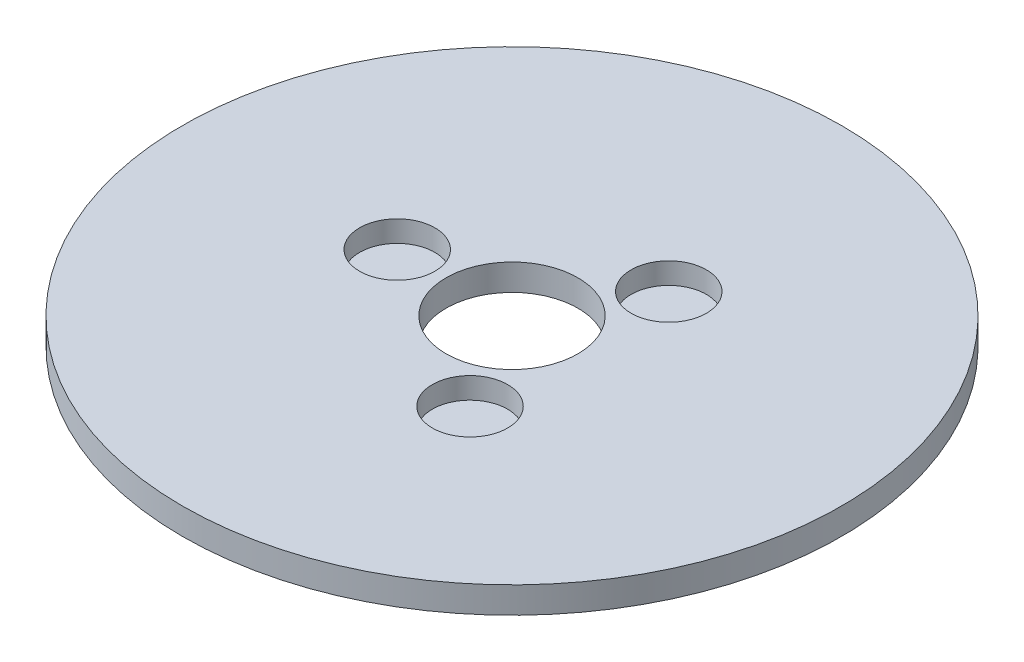
ISO-10303-21;
HEADER;
FILE_DESCRIPTION(('STEP AP214'),'2;1');
FILE_NAME('part.step','',(''),(''),'','','');
FILE_SCHEMA(('AUTOMOTIVE_DESIGN { 1 0 10303 214 1 1 1 1 }'));
ENDSEC;
DATA;
#1=APPLICATION_CONTEXT('core data for automotive mechanical design processes');
#2=APPLICATION_PROTOCOL_DEFINITION('international standard','automotive_design',2000,#1);
#3=PRODUCT_CONTEXT('',#1,'mechanical');
#4=PRODUCT('Part','Part','',(#3));
#5=PRODUCT_RELATED_PRODUCT_CATEGORY('part','',(#4));
#6=PRODUCT_DEFINITION_FORMATION('','',#4);
#7=PRODUCT_DEFINITION_CONTEXT('part definition',#1,'design');
#8=PRODUCT_DEFINITION('design','',#6,#7);
#9=PRODUCT_DEFINITION_SHAPE('','',#8);
#10=(LENGTH_UNIT() NAMED_UNIT(*) SI_UNIT(.MILLI.,.METRE.));
#11=(NAMED_UNIT(*) PLANE_ANGLE_UNIT() SI_UNIT($,.RADIAN.));
#12=(NAMED_UNIT(*) SI_UNIT($,.STERADIAN.) SOLID_ANGLE_UNIT());
#13=UNCERTAINTY_MEASURE_WITH_UNIT(LENGTH_MEASURE(1.E-05),#10,'distance_accuracy_value','');
#14=(GEOMETRIC_REPRESENTATION_CONTEXT(3) GLOBAL_UNCERTAINTY_ASSIGNED_CONTEXT((#13)) GLOBAL_UNIT_ASSIGNED_CONTEXT((#10,
#11,#12)) REPRESENTATION_CONTEXT('',''));
#15=CARTESIAN_POINT('',(0.,0.,0.));
#16=DIRECTION('',(0.,0.,1.));
#17=DIRECTION('',(1.,0.,0.));
#18=AXIS2_PLACEMENT_3D('',#15,#16,#17);
#19=CARTESIAN_POINT('',(0.,7.,0.));
#20=DIRECTION('',(0.,-1.,0.));
#21=DIRECTION('',(0.,0.,-1.));
#22=AXIS2_PLACEMENT_3D('',#19,#20,#21);
#23=CYLINDRICAL_SURFACE('',#22,87.5);
#24=CARTESIAN_POINT('',(0.,7.,0.));
#25=DIRECTION('',(0.,1.,0.));
#26=DIRECTION('',(0.,0.,1.));
#27=AXIS2_PLACEMENT_3D('',#24,#25,#26);
#28=CIRCLE('',#27,87.5);
#29=CARTESIAN_POINT('',(0.,7.,87.5));
#30=VERTEX_POINT('',#29);
#31=EDGE_CURVE('E10',#30,#30,#28,.T.);
#32=ORIENTED_EDGE('',*,*,#31,.F.);
#33=EDGE_LOOP('',(#32));
#34=FACE_BOUND('',#33,.T.);
#35=CARTESIAN_POINT('',(0.,0.,0.));
#36=DIRECTION('',(0.,1.,0.));
#37=DIRECTION('',(0.,0.,1.));
#38=AXIS2_PLACEMENT_3D('',#35,#36,#37);
#39=CIRCLE('',#38,87.5);
#40=CARTESIAN_POINT('',(0.,0.,87.5));
#41=VERTEX_POINT('',#40);
#42=EDGE_CURVE('E37',#41,#41,#39,.T.);
#43=ORIENTED_EDGE('',*,*,#42,.T.);
#44=EDGE_LOOP('',(#43));
#45=FACE_BOUND('',#44,.T.);
#46=ADVANCED_FACE('F40',(#34,#45),#23,.T.);
#47=CARTESIAN_POINT('',(0.,7.,0.));
#48=DIRECTION('',(0.,1.,0.));
#49=DIRECTION('',(0.,0.,1.));
#50=AXIS2_PLACEMENT_3D('',#47,#48,#49);
#51=PLANE('',#50);
#52=CARTESIAN_POINT('',(15.2350539332547,7.,26.3878874684488));
#53=DIRECTION('',(0.,1.,0.));
#54=DIRECTION('',(0.866025403784436,0.,-0.500000000000004));
#55=AXIS2_PLACEMENT_3D('',#52,#53,#54);
#56=CIRCLE('',#55,10.);
#57=CARTESIAN_POINT('',(15.2350539332547,7.,36.3878874684488));
#58=VERTEX_POINT('',#57);
#59=EDGE_CURVE('E70',#58,#58,#56,.T.);
#60=ORIENTED_EDGE('',*,*,#59,.F.);
#61=EDGE_LOOP('',(#60));
#62=FACE_BOUND('',#61,.T.);
#63=CARTESIAN_POINT('',(15.2350539332543,7.,-26.387887468449));
#64=DIRECTION('',(0.,1.,0.));
#65=DIRECTION('',(-0.866025403784443,0.,-0.499999999999992));
#66=AXIS2_PLACEMENT_3D('',#63,#64,#65);
#67=CIRCLE('',#66,10.);
#68=CARTESIAN_POINT('',(15.2350539332543,7.,-16.387887468449));
#69=VERTEX_POINT('',#68);
#70=EDGE_CURVE('E61',#69,#69,#67,.T.);
#71=ORIENTED_EDGE('',*,*,#70,.F.);
#72=EDGE_LOOP('',(#71));
#73=FACE_BOUND('',#72,.T.);
#74=CARTESIAN_POINT('',(-30.4701078665091,7.,0.));
#75=DIRECTION('',(0.,1.,0.));
#76=DIRECTION('',(0.,0.,1.));
#77=AXIS2_PLACEMENT_3D('',#74,#75,#76);
#78=CIRCLE('',#77,10.);
#79=CARTESIAN_POINT('',(-30.4701078665091,7.,10.));
#80=VERTEX_POINT('',#79);
#81=EDGE_CURVE('E54',#80,#80,#78,.T.);
#82=ORIENTED_EDGE('',*,*,#81,.F.);
#83=EDGE_LOOP('',(#82));
#84=FACE_BOUND('',#83,.T.);
#85=CARTESIAN_POINT('',(0.,7.,0.));
#86=DIRECTION('',(0.,1.,0.));
#87=DIRECTION('',(0.,0.,1.));
#88=AXIS2_PLACEMENT_3D('',#85,#86,#87);
#89=CIRCLE('',#88,17.5);
#90=CARTESIAN_POINT('',(0.,7.,17.5));
#91=VERTEX_POINT('',#90);
#92=EDGE_CURVE('E50',#91,#91,#89,.T.);
#93=ORIENTED_EDGE('',*,*,#92,.F.);
#94=EDGE_LOOP('',(#93));
#95=FACE_BOUND('',#94,.T.);
#96=ORIENTED_EDGE('',*,*,#31,.T.);
#97=EDGE_LOOP('',(#96));
#98=FACE_BOUND('',#97,.T.);
#99=ADVANCED_FACE('F85',(#62,#73,#84,#95,#98),#51,.T.);
#100=CARTESIAN_POINT('',(0.,0.,0.));
#101=DIRECTION('',(0.,1.,0.));
#102=DIRECTION('',(0.,0.,1.));
#103=AXIS2_PLACEMENT_3D('',#100,#101,#102);
#104=PLANE('',#103);
#105=CARTESIAN_POINT('',(0.,0.,0.));
#106=DIRECTION('',(0.,1.,0.));
#107=DIRECTION('',(0.,0.,1.));
#108=AXIS2_PLACEMENT_3D('',#105,#106,#107);
#109=CIRCLE('',#108,17.5);
#110=CARTESIAN_POINT('',(0.,0.,17.5));
#111=VERTEX_POINT('',#110);
#112=EDGE_CURVE('E47',#111,#111,#109,.T.);
#113=ORIENTED_EDGE('',*,*,#112,.T.);
#114=EDGE_LOOP('',(#113));
#115=FACE_BOUND('',#114,.T.);
#116=ORIENTED_EDGE('',*,*,#42,.F.);
#117=EDGE_LOOP('',(#116));
#118=FACE_BOUND('',#117,.T.);
#119=ADVANCED_FACE('F84',(#115,#118),#104,.F.);
#120=CARTESIAN_POINT('',(0.,7.,0.));
#121=DIRECTION('',(0.,-1.,0.));
#122=DIRECTION('',(0.,0.,-1.));
#123=AXIS2_PLACEMENT_3D('',#120,#121,#122);
#124=CYLINDRICAL_SURFACE('',#123,17.5);
#125=ORIENTED_EDGE('',*,*,#92,.T.);
#126=EDGE_LOOP('',(#125));
#127=FACE_BOUND('',#126,.T.);
#128=ORIENTED_EDGE('',*,*,#112,.F.);
#129=EDGE_LOOP('',(#128));
#130=FACE_BOUND('',#129,.T.);
#131=ADVANCED_FACE('F91',(#127,#130),#124,.F.);
#132=CARTESIAN_POINT('',(-30.4701078665091,1.33923318185405,0.));
#133=DIRECTION('',(0.,1.,0.));
#134=DIRECTION('',(0.,0.,1.));
#135=AXIS2_PLACEMENT_3D('',#132,#133,#134);
#136=CYLINDRICAL_SURFACE('',#135,10.);
#137=CARTESIAN_POINT('',(-30.4701078665091,1.33923318185405,0.));
#138=DIRECTION('',(0.,1.,0.));
#139=DIRECTION('',(0.,0.,1.));
#140=AXIS2_PLACEMENT_3D('',#137,#138,#139);
#141=CIRCLE('',#140,10.);
#142=CARTESIAN_POINT('',(-30.4701078665091,1.33923318185405,10.));
#143=VERTEX_POINT('',#142);
#144=EDGE_CURVE('E55',#143,#143,#141,.T.);
#145=CARTESIAN_POINT('',(-30.4701078665091,1.33923318185405,10.));
#146=CARTESIAN_POINT('',(-30.4701078665091,1.3981995028764,10.));
#147=CARTESIAN_POINT('',(-30.4701078665091,1.45716582389875,10.));
#148=CARTESIAN_POINT('',(-30.4701078665091,1.57509846594346,10.));
#149=CARTESIAN_POINT('',(-30.4701078665091,1.63406478696581,10.));
#150=CARTESIAN_POINT('',(-30.4701078665091,1.75199742901052,10.));
#151=CARTESIAN_POINT('',(-30.4701078665091,1.81096375003288,10.));
#152=CARTESIAN_POINT('',(-30.4701078665091,1.92889639207758,10.));
#153=CARTESIAN_POINT('',(-30.4701078665091,1.98786271309994,10.));
#154=CARTESIAN_POINT('',(-30.4701078665091,2.10579535514464,10.));
#155=CARTESIAN_POINT('',(-30.4701078665091,2.164761676167,10.));
#156=CARTESIAN_POINT('',(-30.4701078665091,2.2826943182117,10.));
#157=CARTESIAN_POINT('',(-30.4701078665091,2.34166063923406,10.));
#158=CARTESIAN_POINT('',(-30.4701078665091,2.45959328127877,10.));
#159=CARTESIAN_POINT('',(-30.4701078665091,2.51855960230112,10.));
#160=CARTESIAN_POINT('',(-30.4701078665091,2.63649224434583,10.));
#161=CARTESIAN_POINT('',(-30.4701078665091,2.69545856536818,10.));
#162=CARTESIAN_POINT('',(-30.4701078665091,2.81339120741289,10.));
#163=CARTESIAN_POINT('',(-30.4701078665091,2.87235752843524,10.));
#164=CARTESIAN_POINT('',(-30.4701078665091,2.99029017047995,10.));
#165=CARTESIAN_POINT('',(-30.4701078665091,3.0492564915023,10.));
#166=CARTESIAN_POINT('',(-30.4701078665091,3.16718913354701,10.));
#167=CARTESIAN_POINT('',(-30.4701078665091,3.22615545456936,10.));
#168=CARTESIAN_POINT('',(-30.4701078665091,3.34408809661407,10.));
#169=CARTESIAN_POINT('',(-30.4701078665091,3.40305441763643,10.));
#170=CARTESIAN_POINT('',(-30.4701078665091,3.52098705968113,10.));
#171=CARTESIAN_POINT('',(-30.4701078665091,3.57995338070349,10.));
#172=CARTESIAN_POINT('',(-30.4701078665091,3.69788602274819,10.));
#173=CARTESIAN_POINT('',(-30.4701078665091,3.75685234377055,10.));
#174=CARTESIAN_POINT('',(-30.4701078665091,3.87478498581525,10.));
#175=CARTESIAN_POINT('',(-30.4701078665091,3.93375130683761,10.));
#176=CARTESIAN_POINT('',(-30.4701078665091,4.05168394888232,10.));
#177=CARTESIAN_POINT('',(-30.4701078665091,4.11065026990467,10.));
#178=CARTESIAN_POINT('',(-30.4701078665091,4.22858291194938,10.));
#179=CARTESIAN_POINT('',(-30.4701078665091,4.28754923297173,10.));
#180=CARTESIAN_POINT('',(-30.4701078665091,4.40548187501644,10.));
#181=CARTESIAN_POINT('',(-30.4701078665091,4.46444819603879,10.));
#182=CARTESIAN_POINT('',(-30.4701078665091,4.5823808380835,10.));
#183=CARTESIAN_POINT('',(-30.4701078665091,4.64134715910585,10.));
#184=CARTESIAN_POINT('',(-30.4701078665091,4.75927980115056,10.));
#185=CARTESIAN_POINT('',(-30.4701078665091,4.81824612217291,10.));
#186=CARTESIAN_POINT('',(-30.4701078665091,4.93617876421762,10.));
#187=CARTESIAN_POINT('',(-30.4701078665091,4.99514508523998,10.));
#188=CARTESIAN_POINT('',(-30.4701078665091,5.11307772728468,10.));
#189=CARTESIAN_POINT('',(-30.4701078665091,5.17204404830704,10.));
#190=CARTESIAN_POINT('',(-30.4701078665091,5.28997669035174,10.));
#191=CARTESIAN_POINT('',(-30.4701078665091,5.3489430113741,10.));
#192=CARTESIAN_POINT('',(-30.4701078665091,5.4668756534188,10.));
#193=CARTESIAN_POINT('',(-30.4701078665091,5.52584197444116,10.));
#194=CARTESIAN_POINT('',(-30.4701078665091,5.64377461648586,10.));
#195=CARTESIAN_POINT('',(-30.4701078665091,5.70274093750822,10.));
#196=CARTESIAN_POINT('',(-30.4701078665091,5.82067357955293,10.));
#197=CARTESIAN_POINT('',(-30.4701078665091,5.87963990057528,10.));
#198=CARTESIAN_POINT('',(-30.4701078665091,5.99757254261999,10.));
#199=CARTESIAN_POINT('',(-30.4701078665091,6.05653886364234,10.));
#200=CARTESIAN_POINT('',(-30.4701078665091,6.17447150568705,10.));
#201=CARTESIAN_POINT('',(-30.4701078665091,6.2334378267094,10.));
#202=CARTESIAN_POINT('',(-30.4701078665091,6.35137046875411,10.));
#203=CARTESIAN_POINT('',(-30.4701078665091,6.41033678977646,10.));
#204=CARTESIAN_POINT('',(-30.4701078665091,6.52826943182117,10.));
#205=CARTESIAN_POINT('',(-30.4701078665091,6.58723575284353,10.));
#206=CARTESIAN_POINT('',(-30.4701078665091,6.70516839488823,10.));
#207=CARTESIAN_POINT('',(-30.4701078665091,6.76413471591059,10.));
#208=CARTESIAN_POINT('',(-30.4701078665091,6.88206735795529,10.));
#209=CARTESIAN_POINT('',(-30.4701078665091,6.94103367897765,10.));
#210=CARTESIAN_POINT('',(-30.4701078665091,7.,10.));
#211=B_SPLINE_CURVE_WITH_KNOTS('',3,(#145,#146,#147,#148,#149,#150,#151,#152,#153,#154,#155,
#156,#157,#158,#159,#160,#161,#162,#163,#164,#165,#166,#167,#168,#169,#170,#171,#172,#173,#174,
#175,#176,#177,#178,#179,#180,#181,#182,#183,#184,#185,#186,#187,#188,#189,#190,#191,#192,#193,
#194,#195,#196,#197,#198,#199,#200,#201,#202,#203,#204,#205,#206,#207,#208,#209,#210),
.UNSPECIFIED.,.F.,.F.,(4,2,2,2,2,2,2,2,2,2,2,2,2,2,2,2,2,2,2,2,2,2,2,2,2,2,2,2,2,2,2,2,4),(0.,
0.176898963067061,0.353797926134122,0.530696889201183,0.707595852268244,0.884494815335306,
1.06139377840237,1.23829274146943,1.41519170453649,1.59209066760355,1.76898963067061,
1.94588859373767,2.12278755680473,2.29968651987179,2.47658548293886,2.65348444600592,
2.83038340907298,3.00728237214004,3.1841813352071,3.36108029827416,3.53797926134122,
3.71487822440828,3.89177718747534,4.0686761505424,4.24557511360947,4.42247407667653,
4.59937303974359,4.77627200281065,4.95317096587771,5.13006992894477,5.30696889201183,
5.48386785507889,5.66076681814595),.UNSPECIFIED.);
#212=EDGE_CURVE('BSEAM96',#143,#80,#211,.T.);
#213=ORIENTED_EDGE('',*,*,#144,.F.);
#214=ORIENTED_EDGE('',*,*,#81,.T.);
#215=ORIENTED_EDGE('',*,*,#212,.T.);
#216=ORIENTED_EDGE('',*,*,#212,.F.);
#217=EDGE_LOOP('',(#213,#215,#214,#216));
#218=FACE_BOUND('',#217,.T.);
#219=ADVANCED_FACE('F96',(#218),#136,.F.);
#220=CARTESIAN_POINT('',(-30.4701078665091,1.33923318185405,0.));
#221=DIRECTION('',(0.,1.,0.));
#222=DIRECTION('',(0.,0.,1.));
#223=AXIS2_PLACEMENT_3D('',#220,#221,#222);
#224=PLANE('',#223);
#225=ORIENTED_EDGE('',*,*,#144,.T.);
#226=EDGE_LOOP('',(#225));
#227=FACE_BOUND('',#226,.T.);
#228=ADVANCED_FACE('F127',(#227),#224,.T.);
#229=CARTESIAN_POINT('',(15.2350539332543,1.33923318185405,-26.387887468449));
#230=DIRECTION('',(0.,1.,0.));
#231=DIRECTION('',(0.,0.,1.));
#232=AXIS2_PLACEMENT_3D('',#229,#230,#231);
#233=CYLINDRICAL_SURFACE('',#232,10.);
#234=CARTESIAN_POINT('',(15.2350539332543,1.33923318185405,-26.387887468449));
#235=DIRECTION('',(0.,1.,0.));
#236=DIRECTION('',(-0.866025403784443,0.,-0.499999999999992));
#237=AXIS2_PLACEMENT_3D('',#234,#235,#236);
#238=CIRCLE('',#237,10.);
#239=CARTESIAN_POINT('',(15.2350539332543,1.33923318185405,-16.387887468449));
#240=VERTEX_POINT('',#239);
#241=EDGE_CURVE('E63',#240,#240,#238,.T.);
#242=CARTESIAN_POINT('',(15.2350539332543,1.33923318185405,-16.387887468449));
#243=CARTESIAN_POINT('',(15.2350539332543,1.3981995028764,-16.387887468449));
#244=CARTESIAN_POINT('',(15.2350539332543,1.45716582389875,-16.387887468449));
#245=CARTESIAN_POINT('',(15.2350539332543,1.57509846594346,-16.387887468449));
#246=CARTESIAN_POINT('',(15.2350539332543,1.63406478696581,-16.387887468449));
#247=CARTESIAN_POINT('',(15.2350539332543,1.75199742901052,-16.387887468449));
#248=CARTESIAN_POINT('',(15.2350539332543,1.81096375003288,-16.387887468449));
#249=CARTESIAN_POINT('',(15.2350539332543,1.92889639207758,-16.387887468449));
#250=CARTESIAN_POINT('',(15.2350539332543,1.98786271309994,-16.387887468449));
#251=CARTESIAN_POINT('',(15.2350539332543,2.10579535514464,-16.387887468449));
#252=CARTESIAN_POINT('',(15.2350539332543,2.164761676167,-16.387887468449));
#253=CARTESIAN_POINT('',(15.2350539332543,2.2826943182117,-16.387887468449));
#254=CARTESIAN_POINT('',(15.2350539332543,2.34166063923406,-16.387887468449));
#255=CARTESIAN_POINT('',(15.2350539332543,2.45959328127877,-16.387887468449));
#256=CARTESIAN_POINT('',(15.2350539332543,2.51855960230112,-16.387887468449));
#257=CARTESIAN_POINT('',(15.2350539332543,2.63649224434583,-16.387887468449));
#258=CARTESIAN_POINT('',(15.2350539332543,2.69545856536818,-16.387887468449));
#259=CARTESIAN_POINT('',(15.2350539332543,2.81339120741289,-16.387887468449));
#260=CARTESIAN_POINT('',(15.2350539332543,2.87235752843524,-16.387887468449));
#261=CARTESIAN_POINT('',(15.2350539332543,2.99029017047995,-16.387887468449));
#262=CARTESIAN_POINT('',(15.2350539332543,3.0492564915023,-16.387887468449));
#263=CARTESIAN_POINT('',(15.2350539332543,3.16718913354701,-16.387887468449));
#264=CARTESIAN_POINT('',(15.2350539332543,3.22615545456936,-16.387887468449));
#265=CARTESIAN_POINT('',(15.2350539332543,3.34408809661407,-16.387887468449));
#266=CARTESIAN_POINT('',(15.2350539332543,3.40305441763643,-16.387887468449));
#267=CARTESIAN_POINT('',(15.2350539332543,3.52098705968113,-16.387887468449));
#268=CARTESIAN_POINT('',(15.2350539332543,3.57995338070349,-16.387887468449));
#269=CARTESIAN_POINT('',(15.2350539332543,3.69788602274819,-16.387887468449));
#270=CARTESIAN_POINT('',(15.2350539332543,3.75685234377055,-16.387887468449));
#271=CARTESIAN_POINT('',(15.2350539332543,3.87478498581525,-16.387887468449));
#272=CARTESIAN_POINT('',(15.2350539332543,3.93375130683761,-16.387887468449));
#273=CARTESIAN_POINT('',(15.2350539332543,4.05168394888232,-16.387887468449));
#274=CARTESIAN_POINT('',(15.2350539332543,4.11065026990467,-16.387887468449));
#275=CARTESIAN_POINT('',(15.2350539332543,4.22858291194938,-16.387887468449));
#276=CARTESIAN_POINT('',(15.2350539332543,4.28754923297173,-16.387887468449));
#277=CARTESIAN_POINT('',(15.2350539332543,4.40548187501644,-16.387887468449));
#278=CARTESIAN_POINT('',(15.2350539332543,4.46444819603879,-16.387887468449));
#279=CARTESIAN_POINT('',(15.2350539332543,4.5823808380835,-16.387887468449));
#280=CARTESIAN_POINT('',(15.2350539332543,4.64134715910585,-16.387887468449));
#281=CARTESIAN_POINT('',(15.2350539332543,4.75927980115056,-16.387887468449));
#282=CARTESIAN_POINT('',(15.2350539332543,4.81824612217291,-16.387887468449));
#283=CARTESIAN_POINT('',(15.2350539332543,4.93617876421762,-16.387887468449));
#284=CARTESIAN_POINT('',(15.2350539332543,4.99514508523998,-16.387887468449));
#285=CARTESIAN_POINT('',(15.2350539332543,5.11307772728468,-16.387887468449));
#286=CARTESIAN_POINT('',(15.2350539332543,5.17204404830704,-16.387887468449));
#287=CARTESIAN_POINT('',(15.2350539332543,5.28997669035174,-16.387887468449));
#288=CARTESIAN_POINT('',(15.2350539332543,5.3489430113741,-16.387887468449));
#289=CARTESIAN_POINT('',(15.2350539332543,5.4668756534188,-16.387887468449));
#290=CARTESIAN_POINT('',(15.2350539332543,5.52584197444116,-16.387887468449));
#291=CARTESIAN_POINT('',(15.2350539332543,5.64377461648586,-16.387887468449));
#292=CARTESIAN_POINT('',(15.2350539332543,5.70274093750822,-16.387887468449));
#293=CARTESIAN_POINT('',(15.2350539332543,5.82067357955293,-16.387887468449));
#294=CARTESIAN_POINT('',(15.2350539332543,5.87963990057528,-16.387887468449));
#295=CARTESIAN_POINT('',(15.2350539332543,5.99757254261999,-16.387887468449));
#296=CARTESIAN_POINT('',(15.2350539332543,6.05653886364234,-16.387887468449));
#297=CARTESIAN_POINT('',(15.2350539332543,6.17447150568705,-16.387887468449));
#298=CARTESIAN_POINT('',(15.2350539332543,6.2334378267094,-16.387887468449));
#299=CARTESIAN_POINT('',(15.2350539332543,6.35137046875411,-16.387887468449));
#300=CARTESIAN_POINT('',(15.2350539332543,6.41033678977646,-16.387887468449));
#301=CARTESIAN_POINT('',(15.2350539332543,6.52826943182117,-16.387887468449));
#302=CARTESIAN_POINT('',(15.2350539332543,6.58723575284353,-16.387887468449));
#303=CARTESIAN_POINT('',(15.2350539332543,6.70516839488823,-16.387887468449));
#304=CARTESIAN_POINT('',(15.2350539332543,6.76413471591059,-16.387887468449));
#305=CARTESIAN_POINT('',(15.2350539332543,6.88206735795529,-16.387887468449));
#306=CARTESIAN_POINT('',(15.2350539332543,6.94103367897765,-16.387887468449));
#307=CARTESIAN_POINT('',(15.2350539332543,7.,-16.387887468449));
#308=B_SPLINE_CURVE_WITH_KNOTS('',3,(#242,#243,#244,#245,#246,#247,#248,#249,#250,#251,#252,
#253,#254,#255,#256,#257,#258,#259,#260,#261,#262,#263,#264,#265,#266,#267,#268,#269,#270,#271,
#272,#273,#274,#275,#276,#277,#278,#279,#280,#281,#282,#283,#284,#285,#286,#287,#288,#289,#290,
#291,#292,#293,#294,#295,#296,#297,#298,#299,#300,#301,#302,#303,#304,#305,#306,#307),
.UNSPECIFIED.,.F.,.F.,(4,2,2,2,2,2,2,2,2,2,2,2,2,2,2,2,2,2,2,2,2,2,2,2,2,2,2,2,2,2,2,2,4),(0.,
0.176898963067061,0.353797926134122,0.530696889201183,0.707595852268244,0.884494815335306,
1.06139377840237,1.23829274146943,1.41519170453649,1.59209066760355,1.76898963067061,
1.94588859373767,2.12278755680473,2.29968651987179,2.47658548293886,2.65348444600592,
2.83038340907298,3.00728237214004,3.1841813352071,3.36108029827416,3.53797926134122,
3.71487822440828,3.89177718747534,4.0686761505424,4.24557511360947,4.42247407667653,
4.59937303974359,4.77627200281065,4.95317096587771,5.13006992894477,5.30696889201183,
5.48386785507889,5.66076681814595),.UNSPECIFIED.);
#309=EDGE_CURVE('BSEAM133',#240,#69,#308,.T.);
#310=ORIENTED_EDGE('',*,*,#241,.F.);
#311=ORIENTED_EDGE('',*,*,#70,.T.);
#312=ORIENTED_EDGE('',*,*,#309,.T.);
#313=ORIENTED_EDGE('',*,*,#309,.F.);
#314=EDGE_LOOP('',(#310,#312,#311,#313));
#315=FACE_BOUND('',#314,.T.);
#316=ADVANCED_FACE('F133',(#315),#233,.F.);
#317=CARTESIAN_POINT('',(15.2350539332543,1.33923318185405,-26.387887468449));
#318=DIRECTION('',(0.,1.,0.));
#319=DIRECTION('',(-0.866025403784443,0.,-0.499999999999992));
#320=AXIS2_PLACEMENT_3D('',#317,#318,#319);
#321=PLANE('',#320);
#322=ORIENTED_EDGE('',*,*,#241,.T.);
#323=EDGE_LOOP('',(#322));
#324=FACE_BOUND('',#323,.T.);
#325=ADVANCED_FACE('F77',(#324),#321,.T.);
#326=CARTESIAN_POINT('',(15.2350539332547,1.33923318185405,26.3878874684488));
#327=DIRECTION('',(0.,1.,0.));
#328=DIRECTION('',(0.,0.,1.));
#329=AXIS2_PLACEMENT_3D('',#326,#327,#328);
#330=CYLINDRICAL_SURFACE('',#329,10.);
#331=CARTESIAN_POINT('',(15.2350539332547,1.33923318185405,26.3878874684488));
#332=DIRECTION('',(0.,1.,0.));
#333=DIRECTION('',(0.866025403784436,0.,-0.500000000000004));
#334=AXIS2_PLACEMENT_3D('',#331,#332,#333);
#335=CIRCLE('',#334,10.);
#336=CARTESIAN_POINT('',(15.2350539332547,1.33923318185405,36.3878874684488));
#337=VERTEX_POINT('',#336);
#338=EDGE_CURVE('E59',#337,#337,#335,.T.);
#339=CARTESIAN_POINT('',(15.2350539332547,1.33923318185405,36.3878874684488));
#340=CARTESIAN_POINT('',(15.2350539332547,1.3981995028764,36.3878874684488));
#341=CARTESIAN_POINT('',(15.2350539332547,1.45716582389875,36.3878874684488));
#342=CARTESIAN_POINT('',(15.2350539332547,1.57509846594346,36.3878874684488));
#343=CARTESIAN_POINT('',(15.2350539332547,1.63406478696581,36.3878874684488));
#344=CARTESIAN_POINT('',(15.2350539332547,1.75199742901052,36.3878874684488));
#345=CARTESIAN_POINT('',(15.2350539332547,1.81096375003288,36.3878874684488));
#346=CARTESIAN_POINT('',(15.2350539332547,1.92889639207758,36.3878874684488));
#347=CARTESIAN_POINT('',(15.2350539332547,1.98786271309994,36.3878874684488));
#348=CARTESIAN_POINT('',(15.2350539332547,2.10579535514464,36.3878874684488));
#349=CARTESIAN_POINT('',(15.2350539332547,2.164761676167,36.3878874684488));
#350=CARTESIAN_POINT('',(15.2350539332547,2.2826943182117,36.3878874684488));
#351=CARTESIAN_POINT('',(15.2350539332547,2.34166063923406,36.3878874684488));
#352=CARTESIAN_POINT('',(15.2350539332547,2.45959328127877,36.3878874684488));
#353=CARTESIAN_POINT('',(15.2350539332547,2.51855960230112,36.3878874684488));
#354=CARTESIAN_POINT('',(15.2350539332547,2.63649224434583,36.3878874684488));
#355=CARTESIAN_POINT('',(15.2350539332547,2.69545856536818,36.3878874684488));
#356=CARTESIAN_POINT('',(15.2350539332547,2.81339120741289,36.3878874684488));
#357=CARTESIAN_POINT('',(15.2350539332547,2.87235752843524,36.3878874684488));
#358=CARTESIAN_POINT('',(15.2350539332547,2.99029017047995,36.3878874684488));
#359=CARTESIAN_POINT('',(15.2350539332547,3.0492564915023,36.3878874684488));
#360=CARTESIAN_POINT('',(15.2350539332547,3.16718913354701,36.3878874684488));
#361=CARTESIAN_POINT('',(15.2350539332547,3.22615545456936,36.3878874684488));
#362=CARTESIAN_POINT('',(15.2350539332547,3.34408809661407,36.3878874684488));
#363=CARTESIAN_POINT('',(15.2350539332547,3.40305441763643,36.3878874684488));
#364=CARTESIAN_POINT('',(15.2350539332547,3.52098705968113,36.3878874684488));
#365=CARTESIAN_POINT('',(15.2350539332547,3.57995338070349,36.3878874684488));
#366=CARTESIAN_POINT('',(15.2350539332547,3.69788602274819,36.3878874684488));
#367=CARTESIAN_POINT('',(15.2350539332547,3.75685234377055,36.3878874684488));
#368=CARTESIAN_POINT('',(15.2350539332547,3.87478498581525,36.3878874684488));
#369=CARTESIAN_POINT('',(15.2350539332547,3.93375130683761,36.3878874684488));
#370=CARTESIAN_POINT('',(15.2350539332547,4.05168394888232,36.3878874684488));
#371=CARTESIAN_POINT('',(15.2350539332547,4.11065026990467,36.3878874684488));
#372=CARTESIAN_POINT('',(15.2350539332547,4.22858291194938,36.3878874684488));
#373=CARTESIAN_POINT('',(15.2350539332547,4.28754923297173,36.3878874684488));
#374=CARTESIAN_POINT('',(15.2350539332547,4.40548187501644,36.3878874684488));
#375=CARTESIAN_POINT('',(15.2350539332547,4.46444819603879,36.3878874684488));
#376=CARTESIAN_POINT('',(15.2350539332547,4.5823808380835,36.3878874684488));
#377=CARTESIAN_POINT('',(15.2350539332547,4.64134715910585,36.3878874684488));
#378=CARTESIAN_POINT('',(15.2350539332547,4.75927980115056,36.3878874684488));
#379=CARTESIAN_POINT('',(15.2350539332547,4.81824612217291,36.3878874684488));
#380=CARTESIAN_POINT('',(15.2350539332547,4.93617876421762,36.3878874684488));
#381=CARTESIAN_POINT('',(15.2350539332547,4.99514508523998,36.3878874684488));
#382=CARTESIAN_POINT('',(15.2350539332547,5.11307772728468,36.3878874684488));
#383=CARTESIAN_POINT('',(15.2350539332547,5.17204404830704,36.3878874684488));
#384=CARTESIAN_POINT('',(15.2350539332547,5.28997669035174,36.3878874684488));
#385=CARTESIAN_POINT('',(15.2350539332547,5.3489430113741,36.3878874684488));
#386=CARTESIAN_POINT('',(15.2350539332547,5.4668756534188,36.3878874684488));
#387=CARTESIAN_POINT('',(15.2350539332547,5.52584197444116,36.3878874684488));
#388=CARTESIAN_POINT('',(15.2350539332547,5.64377461648586,36.3878874684488));
#389=CARTESIAN_POINT('',(15.2350539332547,5.70274093750822,36.3878874684488));
#390=CARTESIAN_POINT('',(15.2350539332547,5.82067357955293,36.3878874684488));
#391=CARTESIAN_POINT('',(15.2350539332547,5.87963990057528,36.3878874684488));
#392=CARTESIAN_POINT('',(15.2350539332547,5.99757254261999,36.3878874684488));
#393=CARTESIAN_POINT('',(15.2350539332547,6.05653886364234,36.3878874684488));
#394=CARTESIAN_POINT('',(15.2350539332547,6.17447150568705,36.3878874684488));
#395=CARTESIAN_POINT('',(15.2350539332547,6.2334378267094,36.3878874684488));
#396=CARTESIAN_POINT('',(15.2350539332547,6.35137046875411,36.3878874684488));
#397=CARTESIAN_POINT('',(15.2350539332547,6.41033678977646,36.3878874684488));
#398=CARTESIAN_POINT('',(15.2350539332547,6.52826943182117,36.3878874684488));
#399=CARTESIAN_POINT('',(15.2350539332547,6.58723575284353,36.3878874684488));
#400=CARTESIAN_POINT('',(15.2350539332547,6.70516839488823,36.3878874684488));
#401=CARTESIAN_POINT('',(15.2350539332547,6.76413471591059,36.3878874684488));
#402=CARTESIAN_POINT('',(15.2350539332547,6.88206735795529,36.3878874684488));
#403=CARTESIAN_POINT('',(15.2350539332547,6.94103367897765,36.3878874684488));
#404=CARTESIAN_POINT('',(15.2350539332547,7.,36.3878874684488));
#405=B_SPLINE_CURVE_WITH_KNOTS('',3,(#339,#340,#341,#342,#343,#344,#345,#346,#347,#348,#349,
#350,#351,#352,#353,#354,#355,#356,#357,#358,#359,#360,#361,#362,#363,#364,#365,#366,#367,#368,
#369,#370,#371,#372,#373,#374,#375,#376,#377,#378,#379,#380,#381,#382,#383,#384,#385,#386,#387,
#388,#389,#390,#391,#392,#393,#394,#395,#396,#397,#398,#399,#400,#401,#402,#403,#404),
.UNSPECIFIED.,.F.,.F.,(4,2,2,2,2,2,2,2,2,2,2,2,2,2,2,2,2,2,2,2,2,2,2,2,2,2,2,2,2,2,2,2,4),(0.,
0.176898963067061,0.353797926134122,0.530696889201183,0.707595852268244,0.884494815335306,
1.06139377840237,1.23829274146943,1.41519170453649,1.59209066760355,1.76898963067061,
1.94588859373767,2.12278755680473,2.29968651987179,2.47658548293886,2.65348444600592,
2.83038340907298,3.00728237214004,3.1841813352071,3.36108029827416,3.53797926134122,
3.71487822440828,3.89177718747534,4.0686761505424,4.24557511360947,4.42247407667653,
4.59937303974359,4.77627200281065,4.95317096587771,5.13006992894477,5.30696889201183,
5.48386785507889,5.66076681814595),.UNSPECIFIED.);
#406=EDGE_CURVE('BSEAM73',#337,#58,#405,.T.);
#407=ORIENTED_EDGE('',*,*,#338,.F.);
#408=ORIENTED_EDGE('',*,*,#59,.T.);
#409=ORIENTED_EDGE('',*,*,#406,.T.);
#410=ORIENTED_EDGE('',*,*,#406,.F.);
#411=EDGE_LOOP('',(#407,#409,#408,#410));
#412=FACE_BOUND('',#411,.T.);
#413=ADVANCED_FACE('F73',(#412),#330,.F.);
#414=CARTESIAN_POINT('',(15.2350539332547,1.33923318185405,26.3878874684488));
#415=DIRECTION('',(0.,1.,0.));
#416=DIRECTION('',(0.866025403784436,0.,-0.500000000000004));
#417=AXIS2_PLACEMENT_3D('',#414,#415,#416);
#418=PLANE('',#417);
#419=ORIENTED_EDGE('',*,*,#338,.T.);
#420=EDGE_LOOP('',(#419));
#421=FACE_BOUND('',#420,.T.);
#422=ADVANCED_FACE('F71',(#421),#418,.T.);
#423=CLOSED_SHELL('',(#46,#99,#119,#131,#219,#228,#316,#325,#413,#422));
#424=MANIFOLD_SOLID_BREP('B2',#423);
#425=ADVANCED_BREP_SHAPE_REPRESENTATION('',(#18,#424),#14);
#426=SHAPE_DEFINITION_REPRESENTATION(#9,#425);
ENDSEC;
END-ISO-10303-21;
